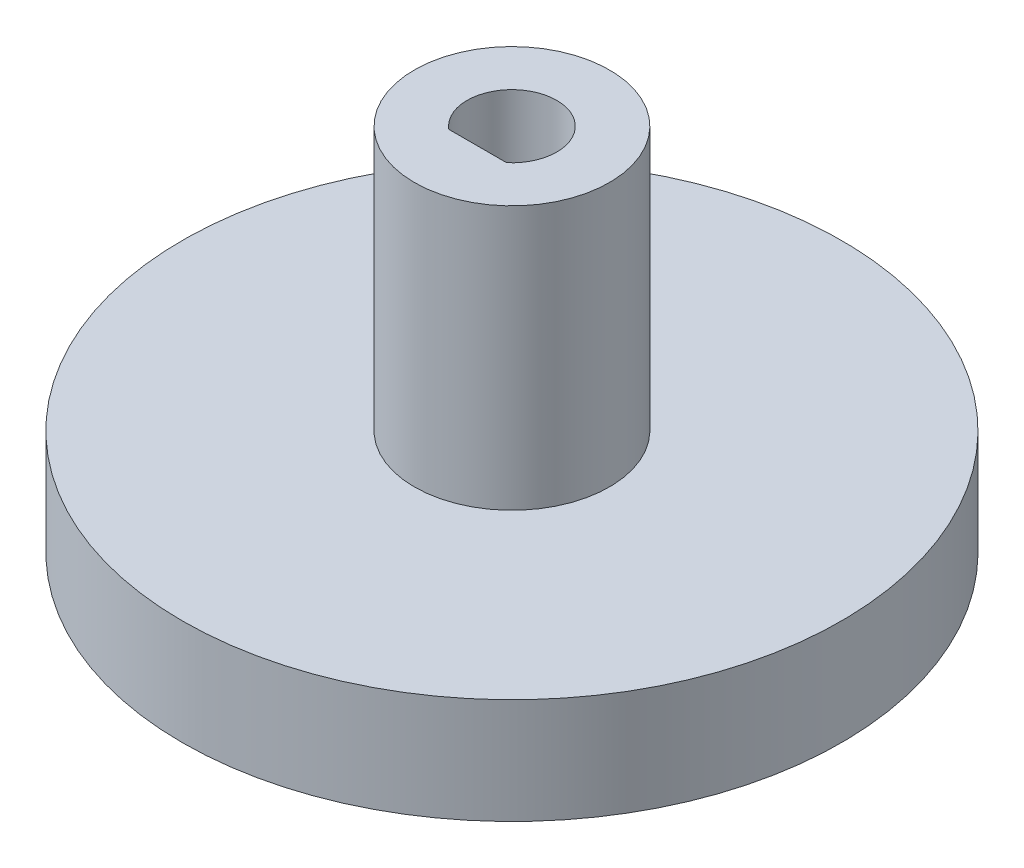
ISO-10303-21;
HEADER;
FILE_DESCRIPTION(('STEP AP214'),'2;1');
FILE_NAME('part.step','',(''),(''),'','','');
FILE_SCHEMA(('AUTOMOTIVE_DESIGN { 1 0 10303 214 1 1 1 1 }'));
ENDSEC;
DATA;
#1=APPLICATION_CONTEXT('core data for automotive mechanical design processes');
#2=APPLICATION_PROTOCOL_DEFINITION('international standard','automotive_design',2000,#1);
#3=PRODUCT_CONTEXT('',#1,'mechanical');
#4=PRODUCT('Part','Part','',(#3));
#5=PRODUCT_RELATED_PRODUCT_CATEGORY('part','',(#4));
#6=PRODUCT_DEFINITION_FORMATION('','',#4);
#7=PRODUCT_DEFINITION_CONTEXT('part definition',#1,'design');
#8=PRODUCT_DEFINITION('design','',#6,#7);
#9=PRODUCT_DEFINITION_SHAPE('','',#8);
#10=(LENGTH_UNIT() NAMED_UNIT(*) SI_UNIT(.MILLI.,.METRE.));
#11=(NAMED_UNIT(*) PLANE_ANGLE_UNIT() SI_UNIT($,.RADIAN.));
#12=(NAMED_UNIT(*) SI_UNIT($,.STERADIAN.) SOLID_ANGLE_UNIT());
#13=UNCERTAINTY_MEASURE_WITH_UNIT(LENGTH_MEASURE(1.E-05),#10,'distance_accuracy_value','');
#14=(GEOMETRIC_REPRESENTATION_CONTEXT(3) GLOBAL_UNCERTAINTY_ASSIGNED_CONTEXT((#13)) GLOBAL_UNIT_ASSIGNED_CONTEXT((#10,
#11,#12)) REPRESENTATION_CONTEXT('',''));
#15=CARTESIAN_POINT('',(0.,0.,0.));
#16=DIRECTION('',(0.,0.,1.));
#17=DIRECTION('',(1.,0.,0.));
#18=AXIS2_PLACEMENT_3D('',#15,#16,#17);
#19=CARTESIAN_POINT('',(0.,4.,0.));
#20=DIRECTION('',(0.,1.,0.));
#21=DIRECTION('',(0.,0.,1.));
#22=AXIS2_PLACEMENT_3D('',#19,#20,#21);
#23=PLANE('',#22);
#24=CARTESIAN_POINT('',(0.,4.,0.));
#25=DIRECTION('',(0.,1.,0.));
#26=DIRECTION('',(0.,0.,1.));
#27=AXIS2_PLACEMENT_3D('',#24,#25,#26);
#28=CIRCLE('',#27,12.5);
#29=CARTESIAN_POINT('',(0.,4.,12.5));
#30=VERTEX_POINT('',#29);
#31=EDGE_CURVE('E81',#30,#30,#28,.T.);
#32=ORIENTED_EDGE('',*,*,#31,.T.);
#33=EDGE_LOOP('',(#32));
#34=FACE_BOUND('',#33,.T.);
#35=CARTESIAN_POINT('',(0.,4.,0.));
#36=DIRECTION('',(0.,1.,0.));
#37=DIRECTION('',(0.,0.,1.));
#38=AXIS2_PLACEMENT_3D('',#35,#36,#37);
#39=CIRCLE('',#38,3.7);
#40=CARTESIAN_POINT('',(0.,4.,3.7));
#41=VERTEX_POINT('',#40);
#42=EDGE_CURVE('E71',#41,#41,#39,.T.);
#43=ORIENTED_EDGE('',*,*,#42,.F.);
#44=EDGE_LOOP('',(#43));
#45=FACE_BOUND('',#44,.T.);
#46=ADVANCED_FACE('F39',(#34,#45),#23,.T.);
#47=CARTESIAN_POINT('',(0.,4.,0.));
#48=DIRECTION('',(0.,-1.,0.));
#49=DIRECTION('',(0.,0.,-1.));
#50=AXIS2_PLACEMENT_3D('',#47,#48,#49);
#51=CYLINDRICAL_SURFACE('',#50,1.7);
#52=CARTESIAN_POINT('',(0.,0.,0.));
#53=DIRECTION('',(0.,1.,0.));
#54=DIRECTION('',(0.,0.,1.));
#55=AXIS2_PLACEMENT_3D('',#52,#53,#54);
#56=CIRCLE('',#55,1.7);
#57=CARTESIAN_POINT('',(1.09544511501033,0.,1.3));
#58=VERTEX_POINT('',#57);
#59=CARTESIAN_POINT('',(-1.09544511501033,0.,1.3));
#60=VERTEX_POINT('',#59);
#61=EDGE_CURVE('E66',#58,#60,#56,.T.);
#62=ORIENTED_EDGE('',*,*,#61,.F.);
#63=DIRECTION('',(0.,-1.,0.));
#64=VECTOR('',#63,1.);
#65=CARTESIAN_POINT('',(1.09544511501033,4.,1.3));
#66=LINE('',#65,#64);
#67=CARTESIAN_POINT('',(1.09544511501033,14.,1.3));
#68=VERTEX_POINT('',#67);
#69=EDGE_CURVE('E11',#68,#58,#66,.T.);
#70=ORIENTED_EDGE('',*,*,#69,.F.);
#71=CARTESIAN_POINT('',(0.,14.,0.));
#72=DIRECTION('',(0.,1.,0.));
#73=DIRECTION('',(0.,0.,-1.));
#74=AXIS2_PLACEMENT_3D('',#71,#72,#73);
#75=CIRCLE('',#74,1.7);
#76=CARTESIAN_POINT('',(-1.09544511501033,14.,1.3));
#77=VERTEX_POINT('',#76);
#78=EDGE_CURVE('E64',#68,#77,#75,.T.);
#79=ORIENTED_EDGE('',*,*,#78,.T.);
#80=DIRECTION('',(0.,-1.,0.));
#81=VECTOR('',#80,1.);
#82=CARTESIAN_POINT('',(-1.09544511501033,4.,1.3));
#83=LINE('',#82,#81);
#84=EDGE_CURVE('E47',#77,#60,#83,.T.);
#85=ORIENTED_EDGE('',*,*,#84,.T.);
#86=EDGE_LOOP('',(#62,#70,#79,#85));
#87=FACE_BOUND('',#86,.T.);
#88=ADVANCED_FACE('F41',(#87),#51,.F.);
#89=CARTESIAN_POINT('',(0.,4.,1.3));
#90=DIRECTION('',(0.,0.,-1.));
#91=DIRECTION('',(-1.,0.,0.));
#92=AXIS2_PLACEMENT_3D('',#89,#90,#91);
#93=PLANE('',#92);
#94=DIRECTION('',(1.,0.,0.));
#95=VECTOR('',#94,1.);
#96=CARTESIAN_POINT('',(0.,0.,1.3));
#97=LINE('',#96,#95);
#98=EDGE_CURVE('E86',#60,#58,#97,.T.);
#99=ORIENTED_EDGE('',*,*,#98,.F.);
#100=ORIENTED_EDGE('',*,*,#84,.F.);
#101=DIRECTION('',(1.,0.,0.));
#102=VECTOR('',#101,1.);
#103=CARTESIAN_POINT('',(-1.09544511501033,14.,1.3));
#104=LINE('',#103,#102);
#105=EDGE_CURVE('E68',#77,#68,#104,.T.);
#106=ORIENTED_EDGE('',*,*,#105,.T.);
#107=ORIENTED_EDGE('',*,*,#69,.T.);
#108=EDGE_LOOP('',(#99,#100,#106,#107));
#109=FACE_BOUND('',#108,.T.);
#110=ADVANCED_FACE('F69',(#109),#93,.T.);
#111=CARTESIAN_POINT('',(0.,4.,0.));
#112=DIRECTION('',(0.,-1.,0.));
#113=DIRECTION('',(0.,0.,-1.));
#114=AXIS2_PLACEMENT_3D('',#111,#112,#113);
#115=CYLINDRICAL_SURFACE('',#114,12.5);
#116=ORIENTED_EDGE('',*,*,#31,.F.);
#117=EDGE_LOOP('',(#116));
#118=FACE_BOUND('',#117,.T.);
#119=CARTESIAN_POINT('',(0.,0.,0.));
#120=DIRECTION('',(0.,1.,0.));
#121=DIRECTION('',(0.,0.,1.));
#122=AXIS2_PLACEMENT_3D('',#119,#120,#121);
#123=CIRCLE('',#122,12.5);
#124=CARTESIAN_POINT('',(0.,0.,12.5));
#125=VERTEX_POINT('',#124);
#126=EDGE_CURVE('E84',#125,#125,#123,.T.);
#127=ORIENTED_EDGE('',*,*,#126,.T.);
#128=EDGE_LOOP('',(#127));
#129=FACE_BOUND('',#128,.T.);
#130=ADVANCED_FACE('F91',(#118,#129),#115,.T.);
#131=CARTESIAN_POINT('',(0.,0.,0.));
#132=DIRECTION('',(0.,1.,0.));
#133=DIRECTION('',(0.,0.,1.));
#134=AXIS2_PLACEMENT_3D('',#131,#132,#133);
#135=PLANE('',#134);
#136=ORIENTED_EDGE('',*,*,#61,.T.);
#137=ORIENTED_EDGE('',*,*,#98,.T.);
#138=EDGE_LOOP('',(#136,#137));
#139=FACE_BOUND('',#138,.T.);
#140=ORIENTED_EDGE('',*,*,#126,.F.);
#141=EDGE_LOOP('',(#140));
#142=FACE_BOUND('',#141,.T.);
#143=ADVANCED_FACE('F93',(#139,#142),#135,.F.);
#144=CARTESIAN_POINT('',(0.,14.,0.));
#145=DIRECTION('',(0.,1.,0.));
#146=DIRECTION('',(0.,0.,1.));
#147=AXIS2_PLACEMENT_3D('',#144,#145,#146);
#148=PLANE('',#147);
#149=CARTESIAN_POINT('',(0.,14.,0.));
#150=DIRECTION('',(0.,1.,0.));
#151=DIRECTION('',(0.,0.,1.));
#152=AXIS2_PLACEMENT_3D('',#149,#150,#151);
#153=CIRCLE('',#152,3.7);
#154=CARTESIAN_POINT('',(0.,14.,3.7));
#155=VERTEX_POINT('',#154);
#156=EDGE_CURVE('E76',#155,#155,#153,.T.);
#157=ORIENTED_EDGE('',*,*,#156,.T.);
#158=EDGE_LOOP('',(#157));
#159=FACE_BOUND('',#158,.T.);
#160=ORIENTED_EDGE('',*,*,#105,.F.);
#161=ORIENTED_EDGE('',*,*,#78,.F.);
#162=EDGE_LOOP('',(#160,#161));
#163=FACE_BOUND('',#162,.T.);
#164=ADVANCED_FACE('F73',(#159,#163),#148,.T.);
#165=CARTESIAN_POINT('',(0.,14.,0.));
#166=DIRECTION('',(0.,-1.,0.));
#167=DIRECTION('',(0.,0.,-1.));
#168=AXIS2_PLACEMENT_3D('',#165,#166,#167);
#169=CYLINDRICAL_SURFACE('',#168,3.7);
#170=ORIENTED_EDGE('',*,*,#156,.F.);
#171=EDGE_LOOP('',(#170));
#172=FACE_BOUND('',#171,.T.);
#173=ORIENTED_EDGE('',*,*,#42,.T.);
#174=EDGE_LOOP('',(#173));
#175=FACE_BOUND('',#174,.T.);
#176=ADVANCED_FACE('F101',(#172,#175),#169,.T.);
#177=CLOSED_SHELL('',(#46,#88,#110,#130,#143,#164,#176));
#178=MANIFOLD_SOLID_BREP('B2',#177);
#179=ADVANCED_BREP_SHAPE_REPRESENTATION('',(#18,#178),#14);
#180=SHAPE_DEFINITION_REPRESENTATION(#9,#179);
ENDSEC;
END-ISO-10303-21;
